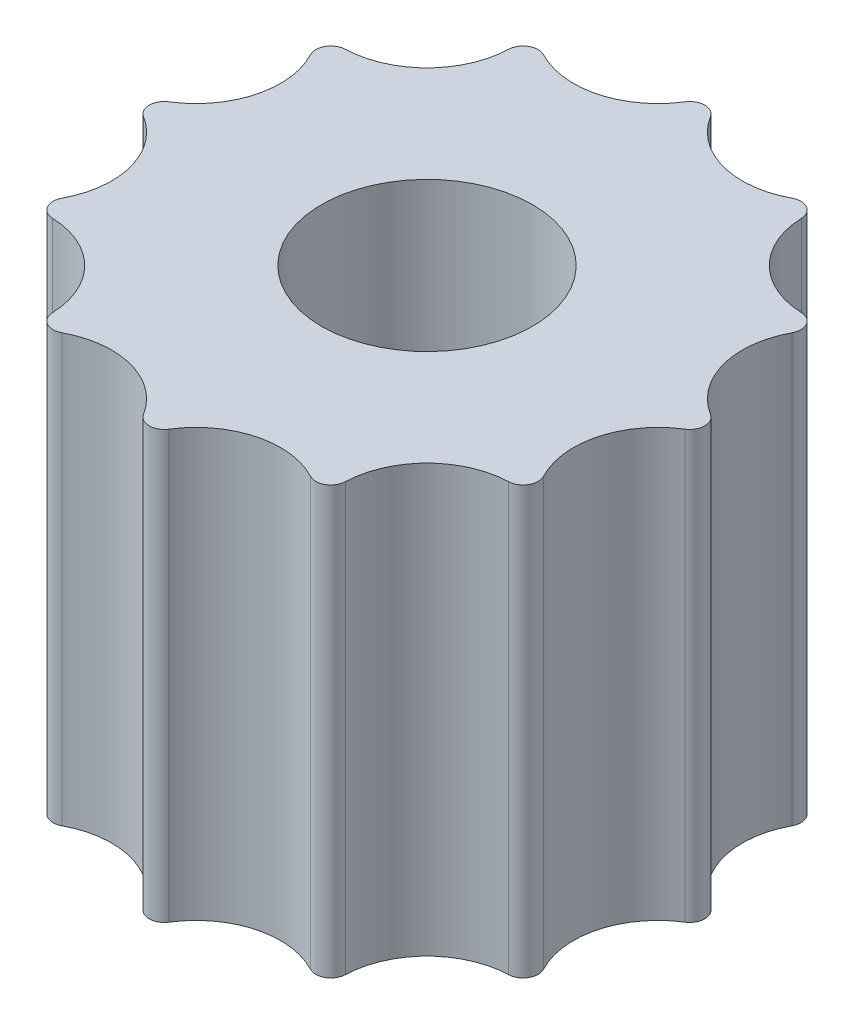
ISO-10303-21;
HEADER;
FILE_DESCRIPTION(('STEP AP214'),'2;1');
FILE_NAME('part.step','',(''),(''),'','','');
FILE_SCHEMA(('AUTOMOTIVE_DESIGN { 1 0 10303 214 1 1 1 1 }'));
ENDSEC;
DATA;
#1=APPLICATION_CONTEXT('core data for automotive mechanical design processes');
#2=APPLICATION_PROTOCOL_DEFINITION('international standard','automotive_design',2000,#1);
#3=PRODUCT_CONTEXT('',#1,'mechanical');
#4=PRODUCT('Part','Part','',(#3));
#5=PRODUCT_RELATED_PRODUCT_CATEGORY('part','',(#4));
#6=PRODUCT_DEFINITION_FORMATION('','',#4);
#7=PRODUCT_DEFINITION_CONTEXT('part definition',#1,'design');
#8=PRODUCT_DEFINITION('design','',#6,#7);
#9=PRODUCT_DEFINITION_SHAPE('','',#8);
#10=(LENGTH_UNIT() NAMED_UNIT(*) SI_UNIT(.MILLI.,.METRE.));
#11=(NAMED_UNIT(*) PLANE_ANGLE_UNIT() SI_UNIT($,.RADIAN.));
#12=(NAMED_UNIT(*) SI_UNIT($,.STERADIAN.) SOLID_ANGLE_UNIT());
#13=UNCERTAINTY_MEASURE_WITH_UNIT(LENGTH_MEASURE(1.E-05),#10,'distance_accuracy_value','');
#14=(GEOMETRIC_REPRESENTATION_CONTEXT(3) GLOBAL_UNCERTAINTY_ASSIGNED_CONTEXT((#13)) GLOBAL_UNIT_ASSIGNED_CONTEXT((#10,
#11,#12)) REPRESENTATION_CONTEXT('',''));
#15=CARTESIAN_POINT('',(0.,0.,0.));
#16=DIRECTION('',(0.,0.,1.));
#17=DIRECTION('',(1.,0.,0.));
#18=AXIS2_PLACEMENT_3D('',#15,#16,#17);
#19=CARTESIAN_POINT('',(-3.13925893543947,8.5,-5.43735597429575));
#20=DIRECTION('',(0.,1.,0.));
#21=DIRECTION('',(0.,0.,1.));
#22=AXIS2_PLACEMENT_3D('',#19,#20,#21);
#23=PLANE('',#22);
#24=CARTESIAN_POINT('',(6.27851787087894,8.5,-1.68232379316639));
#25=DIRECTION('',(0.,-1.,0.));
#26=DIRECTION('',(0.,0.,1.));
#27=AXIS2_PLACEMENT_3D('',#24,#25,#26);
#28=CIRCLE('',#27,1.68256548580232);
#29=CARTESIAN_POINT('',(5.38827118848856,8.5,-0.254567701074287));
#30=VERTEX_POINT('',#29);
#31=CARTESIAN_POINT('',(4.793663582248,8.5,-2.47367349813095));
#32=VERTEX_POINT('',#31);
#33=EDGE_CURVE('E448',#30,#32,#28,.T.);
#34=ORIENTED_EDGE('',*,*,#33,.T.);
#35=CARTESIAN_POINT('',(4.52891532112646,8.5,-2.61477047978938));
#36=DIRECTION('',(0.,1.,0.));
#37=DIRECTION('',(0.,0.,1.));
#38=AXIS2_PLACEMENT_3D('',#35,#36,#37);
#39=CIRCLE('',#38,0.3);
#40=CARTESIAN_POINT('',(4.53909588117372,8.5,-2.91459769035761));
#41=VERTEX_POINT('',#40);
#42=EDGE_CURVE('E318',#32,#41,#39,.T.);
#43=ORIENTED_EDGE('',*,*,#42,.T.);
#44=CARTESIAN_POINT('',(4.59619407771256,8.5,-4.59619407771256));
#45=DIRECTION('',(0.,-1.,0.));
#46=DIRECTION('',(0.,0.,1.));
#47=AXIS2_PLACEMENT_3D('',#44,#45,#46);
#48=CIRCLE('',#47,1.68256548580232);
#49=CARTESIAN_POINT('',(2.91459769035761,8.5,-4.53909588117372));
#50=VERTEX_POINT('',#49);
#51=EDGE_CURVE('E223',#41,#50,#48,.T.);
#52=ORIENTED_EDGE('',*,*,#51,.T.);
#53=CARTESIAN_POINT('',(2.61477047978938,8.5,-4.52891532112647));
#54=DIRECTION('',(0.,1.,0.));
#55=DIRECTION('',(0.,0.,1.));
#56=AXIS2_PLACEMENT_3D('',#53,#54,#55);
#57=CIRCLE('',#56,0.3);
#58=CARTESIAN_POINT('',(2.47367349813094,8.5,-4.79366358224801));
#59=VERTEX_POINT('',#58);
#60=EDGE_CURVE('E286',#50,#59,#57,.T.);
#61=ORIENTED_EDGE('',*,*,#60,.T.);
#62=CARTESIAN_POINT('',(1.68232379316638,8.5,-6.27851787087894));
#63=DIRECTION('',(0.,-1.,0.));
#64=DIRECTION('',(0.,0.,1.));
#65=AXIS2_PLACEMENT_3D('',#62,#63,#64);
#66=CIRCLE('',#65,1.68256548580232);
#67=CARTESIAN_POINT('',(0.254567701074283,8.5,-5.38827118848856));
#68=VERTEX_POINT('',#67);
#69=EDGE_CURVE('E389',#59,#68,#66,.T.);
#70=ORIENTED_EDGE('',*,*,#69,.T.);
#71=CARTESIAN_POINT('',(0.,8.5,-5.22954095957876));
#72=DIRECTION('',(0.,1.,0.));
#73=DIRECTION('',(0.,0.,1.));
#74=AXIS2_PLACEMENT_3D('',#71,#72,#73);
#75=CIRCLE('',#74,0.3);
#76=CARTESIAN_POINT('',(-0.254567701074281,8.5,-5.38827118848856));
#77=VERTEX_POINT('',#76);
#78=EDGE_CURVE('E62',#68,#77,#75,.T.);
#79=ORIENTED_EDGE('',*,*,#78,.T.);
#80=CARTESIAN_POINT('',(-1.68232379316639,8.5,-6.27851787087894));
#81=DIRECTION('',(0.,-1.,0.));
#82=DIRECTION('',(0.,0.,1.));
#83=AXIS2_PLACEMENT_3D('',#80,#81,#82);
#84=CIRCLE('',#83,1.68256548580233);
#85=CARTESIAN_POINT('',(-2.47367349813095,8.5,-4.793663582248));
#86=VERTEX_POINT('',#85);
#87=EDGE_CURVE('E248',#77,#86,#84,.T.);
#88=ORIENTED_EDGE('',*,*,#87,.T.);
#89=CARTESIAN_POINT('',(-2.61477047978939,8.5,-4.52891532112646));
#90=DIRECTION('',(0.,1.,0.));
#91=DIRECTION('',(0.,0.,1.));
#92=AXIS2_PLACEMENT_3D('',#89,#90,#91);
#93=CIRCLE('',#92,0.3);
#94=CARTESIAN_POINT('',(-2.91459769035762,8.5,-4.53909588117372));
#95=VERTEX_POINT('',#94);
#96=EDGE_CURVE('E291',#86,#95,#93,.T.);
#97=ORIENTED_EDGE('',*,*,#96,.T.);
#98=CARTESIAN_POINT('',(-4.59619407771256,8.5,-4.59619407771256));
#99=DIRECTION('',(0.,-1.,0.));
#100=DIRECTION('',(0.,0.,1.));
#101=AXIS2_PLACEMENT_3D('',#98,#99,#100);
#102=CIRCLE('',#101,1.68256548580232);
#103=CARTESIAN_POINT('',(-4.53909588117372,8.5,-2.91459769035761));
#104=VERTEX_POINT('',#103);
#105=EDGE_CURVE('E246',#95,#104,#102,.T.);
#106=ORIENTED_EDGE('',*,*,#105,.T.);
#107=CARTESIAN_POINT('',(-4.52891532112646,8.5,-2.61477047978938));
#108=DIRECTION('',(0.,1.,0.));
#109=DIRECTION('',(0.,0.,1.));
#110=AXIS2_PLACEMENT_3D('',#107,#108,#109);
#111=CIRCLE('',#110,0.3);
#112=CARTESIAN_POINT('',(-4.793663582248,8.5,-2.47367349813094));
#113=VERTEX_POINT('',#112);
#114=EDGE_CURVE('E294',#104,#113,#111,.T.);
#115=ORIENTED_EDGE('',*,*,#114,.T.);
#116=CARTESIAN_POINT('',(-6.27851787087895,8.5,-1.68232379316638));
#117=DIRECTION('',(0.,-1.,0.));
#118=DIRECTION('',(0.,0.,1.));
#119=AXIS2_PLACEMENT_3D('',#116,#117,#118);
#120=CIRCLE('',#119,1.68256548580233);
#121=CARTESIAN_POINT('',(-5.38827118848856,8.5,-0.25456770107427));
#122=VERTEX_POINT('',#121);
#123=EDGE_CURVE('E478',#113,#122,#120,.T.);
#124=ORIENTED_EDGE('',*,*,#123,.T.);
#125=CARTESIAN_POINT('',(-5.22954095957877,8.5,0.));
#126=DIRECTION('',(0.,1.,0.));
#127=DIRECTION('',(0.,0.,1.));
#128=AXIS2_PLACEMENT_3D('',#125,#126,#127);
#129=CIRCLE('',#128,0.3);
#130=CARTESIAN_POINT('',(-5.38827118848856,8.5,0.254567701074296));
#131=VERTEX_POINT('',#130);
#132=EDGE_CURVE('E297',#122,#131,#129,.T.);
#133=ORIENTED_EDGE('',*,*,#132,.T.);
#134=CARTESIAN_POINT('',(-6.27851787087894,8.5,1.6823237931664));
#135=DIRECTION('',(0.,-1.,0.));
#136=DIRECTION('',(0.,0.,1.));
#137=AXIS2_PLACEMENT_3D('',#134,#135,#136);
#138=CIRCLE('',#137,1.68256548580232);
#139=CARTESIAN_POINT('',(-4.793663582248,8.5,2.47367349813095));
#140=VERTEX_POINT('',#139);
#141=EDGE_CURVE('E474',#131,#140,#138,.T.);
#142=ORIENTED_EDGE('',*,*,#141,.T.);
#143=CARTESIAN_POINT('',(-4.52891532112646,8.5,2.61477047978939));
#144=DIRECTION('',(0.,1.,0.));
#145=DIRECTION('',(0.,0.,1.));
#146=AXIS2_PLACEMENT_3D('',#143,#144,#145);
#147=CIRCLE('',#146,0.3);
#148=CARTESIAN_POINT('',(-4.53909588117372,8.5,2.91459769035762));
#149=VERTEX_POINT('',#148);
#150=EDGE_CURVE('E300',#140,#149,#147,.T.);
#151=ORIENTED_EDGE('',*,*,#150,.T.);
#152=CARTESIAN_POINT('',(-4.59619407771256,8.5,4.59619407771257));
#153=DIRECTION('',(0.,-1.,0.));
#154=DIRECTION('',(0.,0.,1.));
#155=AXIS2_PLACEMENT_3D('',#152,#153,#154);
#156=CIRCLE('',#155,1.68256548580232);
#157=CARTESIAN_POINT('',(-2.91459769035761,8.5,4.53909588117373));
#158=VERTEX_POINT('',#157);
#159=EDGE_CURVE('E470',#149,#158,#156,.T.);
#160=ORIENTED_EDGE('',*,*,#159,.T.);
#161=CARTESIAN_POINT('',(-2.61477047978938,8.5,4.52891532112647));
#162=DIRECTION('',(0.,1.,0.));
#163=DIRECTION('',(0.,0.,1.));
#164=AXIS2_PLACEMENT_3D('',#161,#162,#163);
#165=CIRCLE('',#164,0.3);
#166=CARTESIAN_POINT('',(-2.47367349813094,8.5,4.79366358224801));
#167=VERTEX_POINT('',#166);
#168=EDGE_CURVE('E303',#158,#167,#165,.T.);
#169=ORIENTED_EDGE('',*,*,#168,.T.);
#170=CARTESIAN_POINT('',(-1.68232379316638,8.5,6.27851787087895));
#171=DIRECTION('',(0.,-1.,0.));
#172=DIRECTION('',(0.,0.,1.));
#173=AXIS2_PLACEMENT_3D('',#170,#171,#172);
#174=CIRCLE('',#173,1.68256548580232);
#175=CARTESIAN_POINT('',(-0.254567701074279,8.5,5.38827118848856));
#176=VERTEX_POINT('',#175);
#177=EDGE_CURVE('E466',#167,#176,#174,.T.);
#178=ORIENTED_EDGE('',*,*,#177,.T.);
#179=CARTESIAN_POINT('',(0.,8.5,5.22954095957877));
#180=DIRECTION('',(0.,1.,0.));
#181=DIRECTION('',(0.,0.,1.));
#182=AXIS2_PLACEMENT_3D('',#179,#180,#181);
#183=CIRCLE('',#182,0.3);
#184=CARTESIAN_POINT('',(0.254567701074285,8.5,5.38827118848856));
#185=VERTEX_POINT('',#184);
#186=EDGE_CURVE('E306',#176,#185,#183,.T.);
#187=ORIENTED_EDGE('',*,*,#186,.T.);
#188=CARTESIAN_POINT('',(1.68232379316639,8.5,6.27851787087895));
#189=DIRECTION('',(0.,-1.,0.));
#190=DIRECTION('',(0.,0.,1.));
#191=AXIS2_PLACEMENT_3D('',#188,#189,#190);
#192=CIRCLE('',#191,1.68256548580232);
#193=CARTESIAN_POINT('',(2.47367349813095,8.5,4.79366358224801));
#194=VERTEX_POINT('',#193);
#195=EDGE_CURVE('E462',#185,#194,#192,.T.);
#196=ORIENTED_EDGE('',*,*,#195,.T.);
#197=CARTESIAN_POINT('',(2.61477047978939,8.5,4.52891532112647));
#198=DIRECTION('',(0.,1.,0.));
#199=DIRECTION('',(0.,0.,1.));
#200=AXIS2_PLACEMENT_3D('',#197,#198,#199);
#201=CIRCLE('',#200,0.3);
#202=CARTESIAN_POINT('',(2.91459769035762,8.5,4.53909588117372));
#203=VERTEX_POINT('',#202);
#204=EDGE_CURVE('E309',#194,#203,#201,.T.);
#205=ORIENTED_EDGE('',*,*,#204,.T.);
#206=CARTESIAN_POINT('',(4.59619407771256,8.5,4.59619407771256));
#207=DIRECTION('',(0.,-1.,0.));
#208=DIRECTION('',(0.,0.,1.));
#209=AXIS2_PLACEMENT_3D('',#206,#207,#208);
#210=CIRCLE('',#209,1.68256548580232);
#211=CARTESIAN_POINT('',(4.53909588117372,8.5,2.91459769035761));
#212=VERTEX_POINT('',#211);
#213=EDGE_CURVE('E456',#203,#212,#210,.T.);
#214=ORIENTED_EDGE('',*,*,#213,.T.);
#215=CARTESIAN_POINT('',(4.52891532112646,8.5,2.61477047978939));
#216=DIRECTION('',(0.,1.,0.));
#217=DIRECTION('',(0.,0.,1.));
#218=AXIS2_PLACEMENT_3D('',#215,#216,#217);
#219=CIRCLE('',#218,0.3);
#220=CARTESIAN_POINT('',(4.793663582248,8.5,2.47367349813095));
#221=VERTEX_POINT('',#220);
#222=EDGE_CURVE('E312',#212,#221,#219,.T.);
#223=ORIENTED_EDGE('',*,*,#222,.T.);
#224=CARTESIAN_POINT('',(6.27851787087895,8.5,1.68232379316639));
#225=DIRECTION('',(0.,-1.,0.));
#226=DIRECTION('',(0.,0.,1.));
#227=AXIS2_PLACEMENT_3D('',#224,#225,#226);
#228=CIRCLE('',#227,1.68256548580233);
#229=CARTESIAN_POINT('',(5.38827118848856,8.5,0.254567701074279));
#230=VERTEX_POINT('',#229);
#231=EDGE_CURVE('E449',#221,#230,#228,.T.);
#232=ORIENTED_EDGE('',*,*,#231,.T.);
#233=CARTESIAN_POINT('',(5.22954095957877,8.5,0.));
#234=DIRECTION('',(0.,1.,0.));
#235=DIRECTION('',(0.,0.,1.));
#236=AXIS2_PLACEMENT_3D('',#233,#234,#235);
#237=CIRCLE('',#236,0.3);
#238=EDGE_CURVE('E315',#230,#30,#237,.T.);
#239=ORIENTED_EDGE('',*,*,#238,.T.);
#240=EDGE_LOOP('',(#34,#43,#52,#61,#70,#79,#88,#97,#106,#115,#124,#133,#142,#151,#160,#169,#178,
#187,#196,#205,#214,#223,#232,#239));
#241=FACE_BOUND('',#240,.T.);
#242=CARTESIAN_POINT('',(0.,8.5,0.));
#243=DIRECTION('',(0.,1.,0.));
#244=DIRECTION('',(0.,0.,1.));
#245=AXIS2_PLACEMENT_3D('',#242,#243,#244);
#246=CIRCLE('',#245,2.1);
#247=CARTESIAN_POINT('',(0.,8.5,2.1));
#248=VERTEX_POINT('',#247);
#249=EDGE_CURVE('E409',#248,#248,#246,.T.);
#250=ORIENTED_EDGE('',*,*,#249,.F.);
#251=EDGE_LOOP('',(#250));
#252=FACE_BOUND('',#251,.T.);
#253=ADVANCED_FACE('F39',(#241,#252),#23,.T.);
#254=CARTESIAN_POINT('',(-3.13925893543947,0.,-5.43735597429575));
#255=DIRECTION('',(0.,1.,0.));
#256=DIRECTION('',(0.,0.,1.));
#257=AXIS2_PLACEMENT_3D('',#254,#255,#256);
#258=PLANE('',#257);
#259=CARTESIAN_POINT('',(4.59619407771256,0.,-4.59619407771256));
#260=DIRECTION('',(0.,-1.,0.));
#261=DIRECTION('',(0.,0.,1.));
#262=AXIS2_PLACEMENT_3D('',#259,#260,#261);
#263=CIRCLE('',#262,1.68256548580232);
#264=CARTESIAN_POINT('',(4.53909588117372,0.,-2.91459769035761));
#265=VERTEX_POINT('',#264);
#266=CARTESIAN_POINT('',(2.91459769035761,0.,-4.53909588117372));
#267=VERTEX_POINT('',#266);
#268=EDGE_CURVE('E220',#265,#267,#263,.T.);
#269=ORIENTED_EDGE('',*,*,#268,.F.);
#270=CARTESIAN_POINT('',(4.52891532112646,0.,-2.61477047978938));
#271=DIRECTION('',(0.,1.,0.));
#272=DIRECTION('',(0.,0.,1.));
#273=AXIS2_PLACEMENT_3D('',#270,#271,#272);
#274=CIRCLE('',#273,0.3);
#275=CARTESIAN_POINT('',(4.793663582248,0.,-2.47367349813095));
#276=VERTEX_POINT('',#275);
#277=EDGE_CURVE('E202',#265,#276,#274,.F.);
#278=ORIENTED_EDGE('',*,*,#277,.T.);
#279=CARTESIAN_POINT('',(6.27851787087894,0.,-1.68232379316639));
#280=DIRECTION('',(0.,-1.,0.));
#281=DIRECTION('',(0.,0.,1.));
#282=AXIS2_PLACEMENT_3D('',#279,#280,#281);
#283=CIRCLE('',#282,1.68256548580232);
#284=CARTESIAN_POINT('',(5.38827118848856,0.,-0.254567701074287));
#285=VERTEX_POINT('',#284);
#286=EDGE_CURVE('E233',#285,#276,#283,.T.);
#287=ORIENTED_EDGE('',*,*,#286,.F.);
#288=CARTESIAN_POINT('',(5.22954095957877,0.,0.));
#289=DIRECTION('',(0.,1.,0.));
#290=DIRECTION('',(0.,0.,1.));
#291=AXIS2_PLACEMENT_3D('',#288,#289,#290);
#292=CIRCLE('',#291,0.3);
#293=CARTESIAN_POINT('',(5.38827118848856,0.,0.254567701074279));
#294=VERTEX_POINT('',#293);
#295=EDGE_CURVE('E214',#285,#294,#292,.F.);
#296=ORIENTED_EDGE('',*,*,#295,.T.);
#297=CARTESIAN_POINT('',(6.27851787087895,0.,1.68232379316639));
#298=DIRECTION('',(0.,-1.,0.));
#299=DIRECTION('',(0.,0.,1.));
#300=AXIS2_PLACEMENT_3D('',#297,#298,#299);
#301=CIRCLE('',#300,1.68256548580233);
#302=CARTESIAN_POINT('',(4.793663582248,0.,2.47367349813095));
#303=VERTEX_POINT('',#302);
#304=EDGE_CURVE('E240',#303,#294,#301,.T.);
#305=ORIENTED_EDGE('',*,*,#304,.F.);
#306=CARTESIAN_POINT('',(4.52891532112646,0.,2.61477047978939));
#307=DIRECTION('',(0.,1.,0.));
#308=DIRECTION('',(0.,0.,1.));
#309=AXIS2_PLACEMENT_3D('',#306,#307,#308);
#310=CIRCLE('',#309,0.3);
#311=CARTESIAN_POINT('',(4.53909588117372,0.,2.91459769035761));
#312=VERTEX_POINT('',#311);
#313=EDGE_CURVE('E276',#303,#312,#310,.F.);
#314=ORIENTED_EDGE('',*,*,#313,.T.);
#315=CARTESIAN_POINT('',(4.59619407771256,0.,4.59619407771256));
#316=DIRECTION('',(0.,-1.,0.));
#317=DIRECTION('',(0.,0.,1.));
#318=AXIS2_PLACEMENT_3D('',#315,#316,#317);
#319=CIRCLE('',#318,1.68256548580232);
#320=CARTESIAN_POINT('',(2.91459769035762,0.,4.53909588117372));
#321=VERTEX_POINT('',#320);
#322=EDGE_CURVE('E429',#321,#312,#319,.T.);
#323=ORIENTED_EDGE('',*,*,#322,.F.);
#324=CARTESIAN_POINT('',(2.61477047978939,0.,4.52891532112647));
#325=DIRECTION('',(0.,1.,0.));
#326=DIRECTION('',(0.,0.,1.));
#327=AXIS2_PLACEMENT_3D('',#324,#325,#326);
#328=CIRCLE('',#327,0.3);
#329=CARTESIAN_POINT('',(2.47367349813095,0.,4.79366358224801));
#330=VERTEX_POINT('',#329);
#331=EDGE_CURVE('E273',#321,#330,#328,.F.);
#332=ORIENTED_EDGE('',*,*,#331,.T.);
#333=CARTESIAN_POINT('',(1.68232379316639,0.,6.27851787087895));
#334=DIRECTION('',(0.,-1.,0.));
#335=DIRECTION('',(0.,0.,1.));
#336=AXIS2_PLACEMENT_3D('',#333,#334,#335);
#337=CIRCLE('',#336,1.68256548580232);
#338=CARTESIAN_POINT('',(0.254567701074285,0.,5.38827118848856));
#339=VERTEX_POINT('',#338);
#340=EDGE_CURVE('E425',#339,#330,#337,.T.);
#341=ORIENTED_EDGE('',*,*,#340,.F.);
#342=CARTESIAN_POINT('',(0.,0.,5.22954095957877));
#343=DIRECTION('',(0.,1.,0.));
#344=DIRECTION('',(0.,0.,1.));
#345=AXIS2_PLACEMENT_3D('',#342,#343,#344);
#346=CIRCLE('',#345,0.3);
#347=CARTESIAN_POINT('',(-0.254567701074279,0.,5.38827118848856));
#348=VERTEX_POINT('',#347);
#349=EDGE_CURVE('E270',#339,#348,#346,.F.);
#350=ORIENTED_EDGE('',*,*,#349,.T.);
#351=CARTESIAN_POINT('',(-1.68232379316638,0.,6.27851787087895));
#352=DIRECTION('',(0.,-1.,0.));
#353=DIRECTION('',(0.,0.,1.));
#354=AXIS2_PLACEMENT_3D('',#351,#352,#353);
#355=CIRCLE('',#354,1.68256548580232);
#356=CARTESIAN_POINT('',(-2.47367349813094,0.,4.79366358224801));
#357=VERTEX_POINT('',#356);
#358=EDGE_CURVE('E421',#357,#348,#355,.T.);
#359=ORIENTED_EDGE('',*,*,#358,.F.);
#360=CARTESIAN_POINT('',(-2.61477047978938,0.,4.52891532112647));
#361=DIRECTION('',(0.,1.,0.));
#362=DIRECTION('',(0.,0.,1.));
#363=AXIS2_PLACEMENT_3D('',#360,#361,#362);
#364=CIRCLE('',#363,0.3);
#365=CARTESIAN_POINT('',(-2.91459769035761,0.,4.53909588117373));
#366=VERTEX_POINT('',#365);
#367=EDGE_CURVE('E267',#357,#366,#364,.F.);
#368=ORIENTED_EDGE('',*,*,#367,.T.);
#369=CARTESIAN_POINT('',(-4.59619407771256,0.,4.59619407771257));
#370=DIRECTION('',(0.,-1.,0.));
#371=DIRECTION('',(0.,0.,1.));
#372=AXIS2_PLACEMENT_3D('',#369,#370,#371);
#373=CIRCLE('',#372,1.68256548580232);
#374=CARTESIAN_POINT('',(-4.53909588117372,0.,2.91459769035762));
#375=VERTEX_POINT('',#374);
#376=EDGE_CURVE('E417',#375,#366,#373,.T.);
#377=ORIENTED_EDGE('',*,*,#376,.F.);
#378=CARTESIAN_POINT('',(-4.52891532112646,0.,2.61477047978939));
#379=DIRECTION('',(0.,1.,0.));
#380=DIRECTION('',(0.,0.,1.));
#381=AXIS2_PLACEMENT_3D('',#378,#379,#380);
#382=CIRCLE('',#381,0.3);
#383=CARTESIAN_POINT('',(-4.793663582248,0.,2.47367349813095));
#384=VERTEX_POINT('',#383);
#385=EDGE_CURVE('E264',#375,#384,#382,.F.);
#386=ORIENTED_EDGE('',*,*,#385,.T.);
#387=CARTESIAN_POINT('',(-6.27851787087894,0.,1.6823237931664));
#388=DIRECTION('',(0.,-1.,0.));
#389=DIRECTION('',(0.,0.,1.));
#390=AXIS2_PLACEMENT_3D('',#387,#388,#389);
#391=CIRCLE('',#390,1.68256548580232);
#392=CARTESIAN_POINT('',(-5.38827118848856,0.,0.254567701074296));
#393=VERTEX_POINT('',#392);
#394=EDGE_CURVE('E413',#393,#384,#391,.T.);
#395=ORIENTED_EDGE('',*,*,#394,.F.);
#396=CARTESIAN_POINT('',(-5.22954095957877,0.,0.));
#397=DIRECTION('',(0.,1.,0.));
#398=DIRECTION('',(0.,0.,1.));
#399=AXIS2_PLACEMENT_3D('',#396,#397,#398);
#400=CIRCLE('',#399,0.3);
#401=CARTESIAN_POINT('',(-5.38827118848856,0.,-0.25456770107427));
#402=VERTEX_POINT('',#401);
#403=EDGE_CURVE('E261',#393,#402,#400,.F.);
#404=ORIENTED_EDGE('',*,*,#403,.T.);
#405=CARTESIAN_POINT('',(-6.27851787087895,0.,-1.68232379316638));
#406=DIRECTION('',(0.,-1.,0.));
#407=DIRECTION('',(0.,0.,1.));
#408=AXIS2_PLACEMENT_3D('',#405,#406,#407);
#409=CIRCLE('',#408,1.68256548580233);
#410=CARTESIAN_POINT('',(-4.793663582248,0.,-2.47367349813094));
#411=VERTEX_POINT('',#410);
#412=EDGE_CURVE('E408',#411,#402,#409,.T.);
#413=ORIENTED_EDGE('',*,*,#412,.F.);
#414=CARTESIAN_POINT('',(-4.52891532112646,0.,-2.61477047978938));
#415=DIRECTION('',(0.,1.,0.));
#416=DIRECTION('',(0.,0.,1.));
#417=AXIS2_PLACEMENT_3D('',#414,#415,#416);
#418=CIRCLE('',#417,0.3);
#419=CARTESIAN_POINT('',(-4.53909588117372,0.,-2.91459769035761));
#420=VERTEX_POINT('',#419);
#421=EDGE_CURVE('E258',#411,#420,#418,.F.);
#422=ORIENTED_EDGE('',*,*,#421,.T.);
#423=CARTESIAN_POINT('',(-4.59619407771256,0.,-4.59619407771256));
#424=DIRECTION('',(0.,-1.,0.));
#425=DIRECTION('',(0.,0.,1.));
#426=AXIS2_PLACEMENT_3D('',#423,#424,#425);
#427=CIRCLE('',#426,1.68256548580232);
#428=CARTESIAN_POINT('',(-2.91459769035762,0.,-4.53909588117372));
#429=VERTEX_POINT('',#428);
#430=EDGE_CURVE('E404',#429,#420,#427,.T.);
#431=ORIENTED_EDGE('',*,*,#430,.F.);
#432=CARTESIAN_POINT('',(-2.61477047978939,0.,-4.52891532112646));
#433=DIRECTION('',(0.,1.,0.));
#434=DIRECTION('',(0.,0.,1.));
#435=AXIS2_PLACEMENT_3D('',#432,#433,#434);
#436=CIRCLE('',#435,0.3);
#437=CARTESIAN_POINT('',(-2.47367349813095,0.,-4.793663582248));
#438=VERTEX_POINT('',#437);
#439=EDGE_CURVE('E255',#429,#438,#436,.F.);
#440=ORIENTED_EDGE('',*,*,#439,.T.);
#441=CARTESIAN_POINT('',(-1.68232379316639,0.,-6.27851787087894));
#442=DIRECTION('',(0.,-1.,0.));
#443=DIRECTION('',(0.,0.,1.));
#444=AXIS2_PLACEMENT_3D('',#441,#442,#443);
#445=CIRCLE('',#444,1.68256548580233);
#446=CARTESIAN_POINT('',(-0.254567701074281,0.,-5.38827118848856));
#447=VERTEX_POINT('',#446);
#448=EDGE_CURVE('E238',#447,#438,#445,.T.);
#449=ORIENTED_EDGE('',*,*,#448,.F.);
#450=CARTESIAN_POINT('',(0.,0.,-5.22954095957876));
#451=DIRECTION('',(0.,1.,0.));
#452=DIRECTION('',(0.,0.,1.));
#453=AXIS2_PLACEMENT_3D('',#450,#451,#452);
#454=CIRCLE('',#453,0.3);
#455=CARTESIAN_POINT('',(0.254567701074283,0.,-5.38827118848856));
#456=VERTEX_POINT('',#455);
#457=EDGE_CURVE('E252',#447,#456,#454,.F.);
#458=ORIENTED_EDGE('',*,*,#457,.T.);
#459=CARTESIAN_POINT('',(1.68232379316638,0.,-6.27851787087894));
#460=DIRECTION('',(0.,-1.,0.));
#461=DIRECTION('',(0.,0.,1.));
#462=AXIS2_PLACEMENT_3D('',#459,#460,#461);
#463=CIRCLE('',#462,1.68256548580232);
#464=CARTESIAN_POINT('',(2.47367349813094,0.,-4.79366358224801));
#465=VERTEX_POINT('',#464);
#466=EDGE_CURVE('E232',#465,#456,#463,.T.);
#467=ORIENTED_EDGE('',*,*,#466,.F.);
#468=CARTESIAN_POINT('',(2.61477047978938,0.,-4.52891532112647));
#469=DIRECTION('',(0.,1.,0.));
#470=DIRECTION('',(0.,0.,1.));
#471=AXIS2_PLACEMENT_3D('',#468,#469,#470);
#472=CIRCLE('',#471,0.3);
#473=EDGE_CURVE('E225',#465,#267,#472,.F.);
#474=ORIENTED_EDGE('',*,*,#473,.T.);
#475=EDGE_LOOP('',(#269,#278,#287,#296,#305,#314,#323,#332,#341,#350,#359,#368,#377,#386,#395,
#404,#413,#422,#431,#440,#449,#458,#467,#474));
#476=FACE_BOUND('',#475,.T.);
#477=CARTESIAN_POINT('',(0.,0.,0.));
#478=DIRECTION('',(0.,1.,0.));
#479=DIRECTION('',(0.,0.,1.));
#480=AXIS2_PLACEMENT_3D('',#477,#478,#479);
#481=CIRCLE('',#480,2.1);
#482=CARTESIAN_POINT('',(0.,0.,2.1));
#483=VERTEX_POINT('',#482);
#484=EDGE_CURVE('E485',#483,#483,#481,.T.);
#485=ORIENTED_EDGE('',*,*,#484,.T.);
#486=EDGE_LOOP('',(#485));
#487=FACE_BOUND('',#486,.T.);
#488=ADVANCED_FACE('F228',(#476,#487),#258,.F.);
#489=CARTESIAN_POINT('',(-4.59619407771256,8.5,-4.59619407771256));
#490=DIRECTION('',(0.,-1.,0.));
#491=DIRECTION('',(0.,0.,-1.));
#492=AXIS2_PLACEMENT_3D('',#489,#490,#491);
#493=CYLINDRICAL_SURFACE('',#492,1.68256548580232);
#494=ORIENTED_EDGE('',*,*,#430,.T.);
#495=DIRECTION('',(0.,-1.,0.));
#496=VECTOR('',#495,1.);
#497=CARTESIAN_POINT('',(-4.53909588117372,8.5,-2.91459769035761));
#498=LINE('',#497,#496);
#499=EDGE_CURVE('E374',#420,#104,#498,.F.);
#500=ORIENTED_EDGE('',*,*,#499,.T.);
#501=ORIENTED_EDGE('',*,*,#105,.F.);
#502=DIRECTION('',(0.,-1.,0.));
#503=VECTOR('',#502,1.);
#504=CARTESIAN_POINT('',(-2.91459769035762,8.5,-4.53909588117372));
#505=LINE('',#504,#503);
#506=EDGE_CURVE('E370',#95,#429,#505,.T.);
#507=ORIENTED_EDGE('',*,*,#506,.T.);
#508=EDGE_LOOP('',(#494,#500,#501,#507));
#509=FACE_BOUND('',#508,.T.);
#510=ADVANCED_FACE('F500',(#509),#493,.F.);
#511=CARTESIAN_POINT('',(-6.27851787087895,8.5,-1.68232379316638));
#512=DIRECTION('',(0.,-1.,0.));
#513=DIRECTION('',(0.,0.,-1.));
#514=AXIS2_PLACEMENT_3D('',#511,#512,#513);
#515=CYLINDRICAL_SURFACE('',#514,1.68256548580233);
#516=ORIENTED_EDGE('',*,*,#412,.T.);
#517=DIRECTION('',(0.,-1.,0.));
#518=VECTOR('',#517,1.);
#519=CARTESIAN_POINT('',(-5.38827118848856,8.5,-0.25456770107427));
#520=LINE('',#519,#518);
#521=EDGE_CURVE('E367',#402,#122,#520,.F.);
#522=ORIENTED_EDGE('',*,*,#521,.T.);
#523=ORIENTED_EDGE('',*,*,#123,.F.);
#524=DIRECTION('',(0.,-1.,0.));
#525=VECTOR('',#524,1.);
#526=CARTESIAN_POINT('',(-4.793663582248,8.5,-2.47367349813094));
#527=LINE('',#526,#525);
#528=EDGE_CURVE('E363',#113,#411,#527,.T.);
#529=ORIENTED_EDGE('',*,*,#528,.T.);
#530=EDGE_LOOP('',(#516,#522,#523,#529));
#531=FACE_BOUND('',#530,.T.);
#532=ADVANCED_FACE('F533',(#531),#515,.F.);
#533=CARTESIAN_POINT('',(-6.27851787087894,8.5,1.6823237931664));
#534=DIRECTION('',(0.,-1.,0.));
#535=DIRECTION('',(0.,0.,-1.));
#536=AXIS2_PLACEMENT_3D('',#533,#534,#535);
#537=CYLINDRICAL_SURFACE('',#536,1.68256548580232);
#538=ORIENTED_EDGE('',*,*,#394,.T.);
#539=DIRECTION('',(0.,-1.,0.));
#540=VECTOR('',#539,1.);
#541=CARTESIAN_POINT('',(-4.793663582248,8.5,2.47367349813095));
#542=LINE('',#541,#540);
#543=EDGE_CURVE('E360',#384,#140,#542,.F.);
#544=ORIENTED_EDGE('',*,*,#543,.T.);
#545=ORIENTED_EDGE('',*,*,#141,.F.);
#546=DIRECTION('',(0.,-1.,0.));
#547=VECTOR('',#546,1.);
#548=CARTESIAN_POINT('',(-5.38827118848856,8.5,0.254567701074296));
#549=LINE('',#548,#547);
#550=EDGE_CURVE('E356',#131,#393,#549,.T.);
#551=ORIENTED_EDGE('',*,*,#550,.T.);
#552=EDGE_LOOP('',(#538,#544,#545,#551));
#553=FACE_BOUND('',#552,.T.);
#554=ADVANCED_FACE('F529',(#553),#537,.F.);
#555=CARTESIAN_POINT('',(-4.59619407771256,8.5,4.59619407771257));
#556=DIRECTION('',(0.,-1.,0.));
#557=DIRECTION('',(0.,0.,-1.));
#558=AXIS2_PLACEMENT_3D('',#555,#556,#557);
#559=CYLINDRICAL_SURFACE('',#558,1.68256548580232);
#560=ORIENTED_EDGE('',*,*,#376,.T.);
#561=DIRECTION('',(0.,-1.,0.));
#562=VECTOR('',#561,1.);
#563=CARTESIAN_POINT('',(-2.91459769035761,8.5,4.53909588117373));
#564=LINE('',#563,#562);
#565=EDGE_CURVE('E353',#366,#158,#564,.F.);
#566=ORIENTED_EDGE('',*,*,#565,.T.);
#567=ORIENTED_EDGE('',*,*,#159,.F.);
#568=DIRECTION('',(0.,-1.,0.));
#569=VECTOR('',#568,1.);
#570=CARTESIAN_POINT('',(-4.53909588117372,8.5,2.91459769035762));
#571=LINE('',#570,#569);
#572=EDGE_CURVE('E349',#149,#375,#571,.T.);
#573=ORIENTED_EDGE('',*,*,#572,.T.);
#574=EDGE_LOOP('',(#560,#566,#567,#573));
#575=FACE_BOUND('',#574,.T.);
#576=ADVANCED_FACE('F525',(#575),#559,.F.);
#577=CARTESIAN_POINT('',(-1.68232379316638,8.5,6.27851787087895));
#578=DIRECTION('',(0.,-1.,0.));
#579=DIRECTION('',(0.,0.,-1.));
#580=AXIS2_PLACEMENT_3D('',#577,#578,#579);
#581=CYLINDRICAL_SURFACE('',#580,1.68256548580232);
#582=ORIENTED_EDGE('',*,*,#358,.T.);
#583=DIRECTION('',(0.,-1.,0.));
#584=VECTOR('',#583,1.);
#585=CARTESIAN_POINT('',(-0.254567701074279,8.5,5.38827118848856));
#586=LINE('',#585,#584);
#587=EDGE_CURVE('E346',#348,#176,#586,.F.);
#588=ORIENTED_EDGE('',*,*,#587,.T.);
#589=ORIENTED_EDGE('',*,*,#177,.F.);
#590=DIRECTION('',(0.,-1.,0.));
#591=VECTOR('',#590,1.);
#592=CARTESIAN_POINT('',(-2.47367349813094,8.5,4.79366358224801));
#593=LINE('',#592,#591);
#594=EDGE_CURVE('E342',#167,#357,#593,.T.);
#595=ORIENTED_EDGE('',*,*,#594,.T.);
#596=EDGE_LOOP('',(#582,#588,#589,#595));
#597=FACE_BOUND('',#596,.T.);
#598=ADVANCED_FACE('F521',(#597),#581,.F.);
#599=CARTESIAN_POINT('',(1.68232379316639,8.5,6.27851787087895));
#600=DIRECTION('',(0.,-1.,0.));
#601=DIRECTION('',(0.,0.,-1.));
#602=AXIS2_PLACEMENT_3D('',#599,#600,#601);
#603=CYLINDRICAL_SURFACE('',#602,1.68256548580232);
#604=ORIENTED_EDGE('',*,*,#340,.T.);
#605=DIRECTION('',(0.,-1.,0.));
#606=VECTOR('',#605,1.);
#607=CARTESIAN_POINT('',(2.47367349813095,8.5,4.79366358224801));
#608=LINE('',#607,#606);
#609=EDGE_CURVE('E339',#330,#194,#608,.F.);
#610=ORIENTED_EDGE('',*,*,#609,.T.);
#611=ORIENTED_EDGE('',*,*,#195,.F.);
#612=DIRECTION('',(0.,-1.,0.));
#613=VECTOR('',#612,1.);
#614=CARTESIAN_POINT('',(0.254567701074285,8.5,5.38827118848856));
#615=LINE('',#614,#613);
#616=EDGE_CURVE('E335',#185,#339,#615,.T.);
#617=ORIENTED_EDGE('',*,*,#616,.T.);
#618=EDGE_LOOP('',(#604,#610,#611,#617));
#619=FACE_BOUND('',#618,.T.);
#620=ADVANCED_FACE('F517',(#619),#603,.F.);
#621=CARTESIAN_POINT('',(4.59619407771256,8.5,4.59619407771256));
#622=DIRECTION('',(0.,-1.,0.));
#623=DIRECTION('',(0.,0.,-1.));
#624=AXIS2_PLACEMENT_3D('',#621,#622,#623);
#625=CYLINDRICAL_SURFACE('',#624,1.68256548580232);
#626=ORIENTED_EDGE('',*,*,#322,.T.);
#627=DIRECTION('',(0.,-1.,0.));
#628=VECTOR('',#627,1.);
#629=CARTESIAN_POINT('',(4.53909588117372,8.5,2.91459769035761));
#630=LINE('',#629,#628);
#631=EDGE_CURVE('E332',#312,#212,#630,.F.);
#632=ORIENTED_EDGE('',*,*,#631,.T.);
#633=ORIENTED_EDGE('',*,*,#213,.F.);
#634=DIRECTION('',(0.,-1.,0.));
#635=VECTOR('',#634,1.);
#636=CARTESIAN_POINT('',(2.91459769035762,8.5,4.53909588117372));
#637=LINE('',#636,#635);
#638=EDGE_CURVE('E328',#203,#321,#637,.T.);
#639=ORIENTED_EDGE('',*,*,#638,.T.);
#640=EDGE_LOOP('',(#626,#632,#633,#639));
#641=FACE_BOUND('',#640,.T.);
#642=ADVANCED_FACE('F514',(#641),#625,.F.);
#643=CARTESIAN_POINT('',(6.27851787087895,8.5,1.68232379316639));
#644=DIRECTION('',(0.,-1.,0.));
#645=DIRECTION('',(0.,0.,-1.));
#646=AXIS2_PLACEMENT_3D('',#643,#644,#645);
#647=CYLINDRICAL_SURFACE('',#646,1.68256548580233);
#648=ORIENTED_EDGE('',*,*,#304,.T.);
#649=DIRECTION('',(0.,-1.,0.));
#650=VECTOR('',#649,1.);
#651=CARTESIAN_POINT('',(5.38827118848856,8.5,0.254567701074279));
#652=LINE('',#651,#650);
#653=EDGE_CURVE('E325',#294,#230,#652,.F.);
#654=ORIENTED_EDGE('',*,*,#653,.T.);
#655=ORIENTED_EDGE('',*,*,#231,.F.);
#656=DIRECTION('',(0.,-1.,0.));
#657=VECTOR('',#656,1.);
#658=CARTESIAN_POINT('',(4.793663582248,8.5,2.47367349813095));
#659=LINE('',#658,#657);
#660=EDGE_CURVE('E321',#221,#303,#659,.T.);
#661=ORIENTED_EDGE('',*,*,#660,.T.);
#662=EDGE_LOOP('',(#648,#654,#655,#661));
#663=FACE_BOUND('',#662,.T.);
#664=ADVANCED_FACE('F437',(#663),#647,.F.);
#665=CARTESIAN_POINT('',(6.27851787087894,8.5,-1.68232379316639));
#666=DIRECTION('',(0.,-1.,0.));
#667=DIRECTION('',(0.,0.,-1.));
#668=AXIS2_PLACEMENT_3D('',#665,#666,#667);
#669=CYLINDRICAL_SURFACE('',#668,1.68256548580232);
#670=ORIENTED_EDGE('',*,*,#286,.T.);
#671=DIRECTION('',(0.,-1.,0.));
#672=VECTOR('',#671,1.);
#673=CARTESIAN_POINT('',(4.793663582248,8.5,-2.47367349813094));
#674=LINE('',#673,#672);
#675=EDGE_CURVE('E207',#276,#32,#674,.F.);
#676=ORIENTED_EDGE('',*,*,#675,.T.);
#677=ORIENTED_EDGE('',*,*,#33,.F.);
#678=DIRECTION('',(0.,-1.,0.));
#679=VECTOR('',#678,1.);
#680=CARTESIAN_POINT('',(5.38827118848856,8.5,-0.254567701074287));
#681=LINE('',#680,#679);
#682=EDGE_CURVE('E213',#30,#285,#681,.T.);
#683=ORIENTED_EDGE('',*,*,#682,.T.);
#684=EDGE_LOOP('',(#670,#676,#677,#683));
#685=FACE_BOUND('',#684,.T.);
#686=ADVANCED_FACE('F451',(#685),#669,.F.);
#687=CARTESIAN_POINT('',(4.59619407771256,8.5,-4.59619407771256));
#688=DIRECTION('',(0.,-1.,0.));
#689=DIRECTION('',(0.,0.,-1.));
#690=AXIS2_PLACEMENT_3D('',#687,#688,#689);
#691=CYLINDRICAL_SURFACE('',#690,1.68256548580232);
#692=ORIENTED_EDGE('',*,*,#51,.F.);
#693=DIRECTION('',(0.,-1.,0.));
#694=VECTOR('',#693,1.);
#695=CARTESIAN_POINT('',(4.53909588117372,8.5,-2.91459769035761));
#696=LINE('',#695,#694);
#697=EDGE_CURVE('E206',#41,#265,#696,.T.);
#698=ORIENTED_EDGE('',*,*,#697,.T.);
#699=ORIENTED_EDGE('',*,*,#268,.T.);
#700=DIRECTION('',(0.,-1.,0.));
#701=VECTOR('',#700,1.);
#702=CARTESIAN_POINT('',(2.91459769035761,8.5,-4.53909588117372));
#703=LINE('',#702,#701);
#704=EDGE_CURVE('E226',#267,#50,#703,.F.);
#705=ORIENTED_EDGE('',*,*,#704,.T.);
#706=EDGE_LOOP('',(#692,#698,#699,#705));
#707=FACE_BOUND('',#706,.T.);
#708=ADVANCED_FACE('F219',(#707),#691,.F.);
#709=CARTESIAN_POINT('',(1.68232379316638,8.5,-6.27851787087894));
#710=DIRECTION('',(0.,-1.,0.));
#711=DIRECTION('',(0.,0.,-1.));
#712=AXIS2_PLACEMENT_3D('',#709,#710,#711);
#713=CYLINDRICAL_SURFACE('',#712,1.68256548580232);
#714=ORIENTED_EDGE('',*,*,#466,.T.);
#715=DIRECTION('',(0.,-1.,0.));
#716=VECTOR('',#715,1.);
#717=CARTESIAN_POINT('',(0.254567701074282,8.5,-5.38827118848856));
#718=LINE('',#717,#716);
#719=EDGE_CURVE('E11',#456,#68,#718,.F.);
#720=ORIENTED_EDGE('',*,*,#719,.T.);
#721=ORIENTED_EDGE('',*,*,#69,.F.);
#722=DIRECTION('',(0.,-1.,0.));
#723=VECTOR('',#722,1.);
#724=CARTESIAN_POINT('',(2.47367349813094,8.5,-4.79366358224801));
#725=LINE('',#724,#723);
#726=EDGE_CURVE('E48',#59,#465,#725,.T.);
#727=ORIENTED_EDGE('',*,*,#726,.T.);
#728=EDGE_LOOP('',(#714,#720,#721,#727));
#729=FACE_BOUND('',#728,.T.);
#730=ADVANCED_FACE('F387',(#729),#713,.F.);
#731=CARTESIAN_POINT('',(-1.68232379316639,8.5,-6.27851787087894));
#732=DIRECTION('',(0.,-1.,0.));
#733=DIRECTION('',(0.,0.,-1.));
#734=AXIS2_PLACEMENT_3D('',#731,#732,#733);
#735=CYLINDRICAL_SURFACE('',#734,1.68256548580233);
#736=ORIENTED_EDGE('',*,*,#448,.T.);
#737=DIRECTION('',(0.,-1.,0.));
#738=VECTOR('',#737,1.);
#739=CARTESIAN_POINT('',(-2.47367349813095,8.5,-4.793663582248));
#740=LINE('',#739,#738);
#741=EDGE_CURVE('E55',#438,#86,#740,.F.);
#742=ORIENTED_EDGE('',*,*,#741,.T.);
#743=ORIENTED_EDGE('',*,*,#87,.F.);
#744=DIRECTION('',(0.,-1.,0.));
#745=VECTOR('',#744,1.);
#746=CARTESIAN_POINT('',(-0.254567701074281,8.5,-5.38827118848856));
#747=LINE('',#746,#745);
#748=EDGE_CURVE('E377',#77,#447,#747,.T.);
#749=ORIENTED_EDGE('',*,*,#748,.T.);
#750=EDGE_LOOP('',(#736,#742,#743,#749));
#751=FACE_BOUND('',#750,.T.);
#752=ADVANCED_FACE('F396',(#751),#735,.F.);
#753=CARTESIAN_POINT('',(0.,8.5,0.));
#754=DIRECTION('',(0.,-1.,0.));
#755=DIRECTION('',(0.,0.,-1.));
#756=AXIS2_PLACEMENT_3D('',#753,#754,#755);
#757=CYLINDRICAL_SURFACE('',#756,2.1);
#758=ORIENTED_EDGE('',*,*,#249,.T.);
#759=EDGE_LOOP('',(#758));
#760=FACE_BOUND('',#759,.T.);
#761=ORIENTED_EDGE('',*,*,#484,.F.);
#762=EDGE_LOOP('',(#761));
#763=FACE_BOUND('',#762,.T.);
#764=ADVANCED_FACE('F493',(#760,#763),#757,.F.);
#765=CARTESIAN_POINT('',(4.52891532112646,8.5,-2.61477047978938));
#766=DIRECTION('',(0.,-1.,0.));
#767=DIRECTION('',(0.,0.,-1.));
#768=AXIS2_PLACEMENT_3D('',#765,#766,#767);
#769=CYLINDRICAL_SURFACE('',#768,0.3);
#770=ORIENTED_EDGE('',*,*,#42,.F.);
#771=ORIENTED_EDGE('',*,*,#675,.F.);
#772=ORIENTED_EDGE('',*,*,#277,.F.);
#773=ORIENTED_EDGE('',*,*,#697,.F.);
#774=EDGE_LOOP('',(#770,#771,#772,#773));
#775=FACE_BOUND('',#774,.T.);
#776=ADVANCED_FACE('F205',(#775),#769,.T.);
#777=CARTESIAN_POINT('',(5.22954095957877,8.5,0.));
#778=DIRECTION('',(0.,-1.,0.));
#779=DIRECTION('',(0.,0.,-1.));
#780=AXIS2_PLACEMENT_3D('',#777,#778,#779);
#781=CYLINDRICAL_SURFACE('',#780,0.3);
#782=ORIENTED_EDGE('',*,*,#238,.F.);
#783=ORIENTED_EDGE('',*,*,#653,.F.);
#784=ORIENTED_EDGE('',*,*,#295,.F.);
#785=ORIENTED_EDGE('',*,*,#682,.F.);
#786=EDGE_LOOP('',(#782,#783,#784,#785));
#787=FACE_BOUND('',#786,.T.);
#788=ADVANCED_FACE('F443',(#787),#781,.T.);
#789=CARTESIAN_POINT('',(4.52891532112646,8.5,2.61477047978939));
#790=DIRECTION('',(0.,-1.,0.));
#791=DIRECTION('',(0.,0.,-1.));
#792=AXIS2_PLACEMENT_3D('',#789,#790,#791);
#793=CYLINDRICAL_SURFACE('',#792,0.3);
#794=ORIENTED_EDGE('',*,*,#222,.F.);
#795=ORIENTED_EDGE('',*,*,#631,.F.);
#796=ORIENTED_EDGE('',*,*,#313,.F.);
#797=ORIENTED_EDGE('',*,*,#660,.F.);
#798=EDGE_LOOP('',(#794,#795,#796,#797));
#799=FACE_BOUND('',#798,.T.);
#800=ADVANCED_FACE('F545',(#799),#793,.T.);
#801=CARTESIAN_POINT('',(2.61477047978939,8.5,4.52891532112647));
#802=DIRECTION('',(0.,-1.,0.));
#803=DIRECTION('',(0.,0.,-1.));
#804=AXIS2_PLACEMENT_3D('',#801,#802,#803);
#805=CYLINDRICAL_SURFACE('',#804,0.3);
#806=ORIENTED_EDGE('',*,*,#204,.F.);
#807=ORIENTED_EDGE('',*,*,#609,.F.);
#808=ORIENTED_EDGE('',*,*,#331,.F.);
#809=ORIENTED_EDGE('',*,*,#638,.F.);
#810=EDGE_LOOP('',(#806,#807,#808,#809));
#811=FACE_BOUND('',#810,.T.);
#812=ADVANCED_FACE('F548',(#811),#805,.T.);
#813=CARTESIAN_POINT('',(0.,8.5,5.22954095957877));
#814=DIRECTION('',(0.,-1.,0.));
#815=DIRECTION('',(0.,0.,-1.));
#816=AXIS2_PLACEMENT_3D('',#813,#814,#815);
#817=CYLINDRICAL_SURFACE('',#816,0.3);
#818=ORIENTED_EDGE('',*,*,#186,.F.);
#819=ORIENTED_EDGE('',*,*,#587,.F.);
#820=ORIENTED_EDGE('',*,*,#349,.F.);
#821=ORIENTED_EDGE('',*,*,#616,.F.);
#822=EDGE_LOOP('',(#818,#819,#820,#821));
#823=FACE_BOUND('',#822,.T.);
#824=ADVANCED_FACE('F552',(#823),#817,.T.);
#825=CARTESIAN_POINT('',(-2.61477047978938,8.5,4.52891532112647));
#826=DIRECTION('',(0.,-1.,0.));
#827=DIRECTION('',(0.,0.,-1.));
#828=AXIS2_PLACEMENT_3D('',#825,#826,#827);
#829=CYLINDRICAL_SURFACE('',#828,0.3);
#830=ORIENTED_EDGE('',*,*,#168,.F.);
#831=ORIENTED_EDGE('',*,*,#565,.F.);
#832=ORIENTED_EDGE('',*,*,#367,.F.);
#833=ORIENTED_EDGE('',*,*,#594,.F.);
#834=EDGE_LOOP('',(#830,#831,#832,#833));
#835=FACE_BOUND('',#834,.T.);
#836=ADVANCED_FACE('F556',(#835),#829,.T.);
#837=CARTESIAN_POINT('',(-4.52891532112646,8.5,2.61477047978939));
#838=DIRECTION('',(0.,-1.,0.));
#839=DIRECTION('',(0.,0.,-1.));
#840=AXIS2_PLACEMENT_3D('',#837,#838,#839);
#841=CYLINDRICAL_SURFACE('',#840,0.3);
#842=ORIENTED_EDGE('',*,*,#150,.F.);
#843=ORIENTED_EDGE('',*,*,#543,.F.);
#844=ORIENTED_EDGE('',*,*,#385,.F.);
#845=ORIENTED_EDGE('',*,*,#572,.F.);
#846=EDGE_LOOP('',(#842,#843,#844,#845));
#847=FACE_BOUND('',#846,.T.);
#848=ADVANCED_FACE('F560',(#847),#841,.T.);
#849=CARTESIAN_POINT('',(-5.22954095957877,8.5,0.));
#850=DIRECTION('',(0.,-1.,0.));
#851=DIRECTION('',(0.,0.,-1.));
#852=AXIS2_PLACEMENT_3D('',#849,#850,#851);
#853=CYLINDRICAL_SURFACE('',#852,0.3);
#854=ORIENTED_EDGE('',*,*,#132,.F.);
#855=ORIENTED_EDGE('',*,*,#521,.F.);
#856=ORIENTED_EDGE('',*,*,#403,.F.);
#857=ORIENTED_EDGE('',*,*,#550,.F.);
#858=EDGE_LOOP('',(#854,#855,#856,#857));
#859=FACE_BOUND('',#858,.T.);
#860=ADVANCED_FACE('F564',(#859),#853,.T.);
#861=CARTESIAN_POINT('',(-4.52891532112646,8.5,-2.61477047978938));
#862=DIRECTION('',(0.,-1.,0.));
#863=DIRECTION('',(0.,0.,-1.));
#864=AXIS2_PLACEMENT_3D('',#861,#862,#863);
#865=CYLINDRICAL_SURFACE('',#864,0.3);
#866=ORIENTED_EDGE('',*,*,#114,.F.);
#867=ORIENTED_EDGE('',*,*,#499,.F.);
#868=ORIENTED_EDGE('',*,*,#421,.F.);
#869=ORIENTED_EDGE('',*,*,#528,.F.);
#870=EDGE_LOOP('',(#866,#867,#868,#869));
#871=FACE_BOUND('',#870,.T.);
#872=ADVANCED_FACE('F568',(#871),#865,.T.);
#873=CARTESIAN_POINT('',(-2.61477047978939,8.5,-4.52891532112646));
#874=DIRECTION('',(0.,-1.,0.));
#875=DIRECTION('',(0.,0.,-1.));
#876=AXIS2_PLACEMENT_3D('',#873,#874,#875);
#877=CYLINDRICAL_SURFACE('',#876,0.3);
#878=ORIENTED_EDGE('',*,*,#96,.F.);
#879=ORIENTED_EDGE('',*,*,#741,.F.);
#880=ORIENTED_EDGE('',*,*,#439,.F.);
#881=ORIENTED_EDGE('',*,*,#506,.F.);
#882=EDGE_LOOP('',(#878,#879,#880,#881));
#883=FACE_BOUND('',#882,.T.);
#884=ADVANCED_FACE('F572',(#883),#877,.T.);
#885=CARTESIAN_POINT('',(0.,8.5,-5.22954095957876));
#886=DIRECTION('',(0.,-1.,0.));
#887=DIRECTION('',(0.,0.,-1.));
#888=AXIS2_PLACEMENT_3D('',#885,#886,#887);
#889=CYLINDRICAL_SURFACE('',#888,0.3);
#890=ORIENTED_EDGE('',*,*,#78,.F.);
#891=ORIENTED_EDGE('',*,*,#719,.F.);
#892=ORIENTED_EDGE('',*,*,#457,.F.);
#893=ORIENTED_EDGE('',*,*,#748,.F.);
#894=EDGE_LOOP('',(#890,#891,#892,#893));
#895=FACE_BOUND('',#894,.T.);
#896=ADVANCED_FACE('F395',(#895),#889,.T.);
#897=CARTESIAN_POINT('',(2.61477047978938,8.5,-4.52891532112647));
#898=DIRECTION('',(0.,-1.,0.));
#899=DIRECTION('',(0.,0.,-1.));
#900=AXIS2_PLACEMENT_3D('',#897,#898,#899);
#901=CYLINDRICAL_SURFACE('',#900,0.3);
#902=ORIENTED_EDGE('',*,*,#60,.F.);
#903=ORIENTED_EDGE('',*,*,#704,.F.);
#904=ORIENTED_EDGE('',*,*,#473,.F.);
#905=ORIENTED_EDGE('',*,*,#726,.F.);
#906=EDGE_LOOP('',(#902,#903,#904,#905));
#907=FACE_BOUND('',#906,.T.);
#908=ADVANCED_FACE('F41',(#907),#901,.T.);
#909=CLOSED_SHELL('',(#253,#488,#510,#532,#554,#576,#598,#620,#642,#664,#686,#708,#730,#752,
#764,#776,#788,#800,#812,#824,#836,#848,#860,#872,#884,#896,#908));
#910=MANIFOLD_SOLID_BREP('B2',#909);
#911=ADVANCED_BREP_SHAPE_REPRESENTATION('',(#18,#910),#14);
#912=SHAPE_DEFINITION_REPRESENTATION(#9,#911);
ENDSEC;
END-ISO-10303-21;
